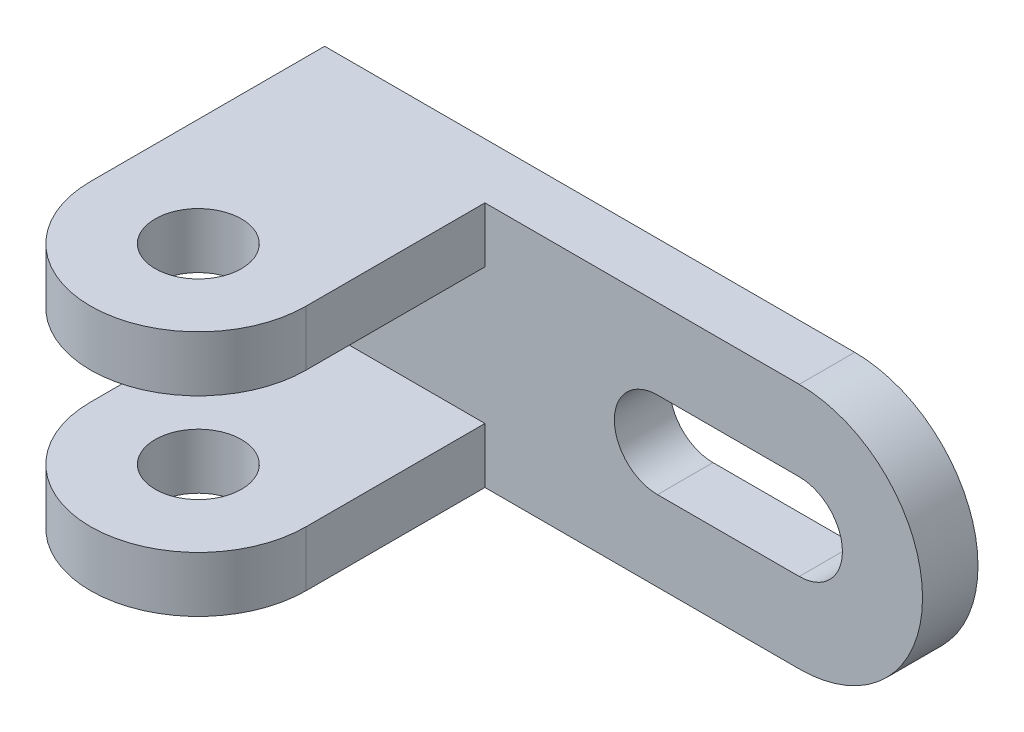
ISO-10303-21;
HEADER;
FILE_DESCRIPTION(('STEP AP214'),'2;1');
FILE_NAME('part.step','',(''),(''),'','','');
FILE_SCHEMA(('AUTOMOTIVE_DESIGN { 1 0 10303 214 1 1 1 1 }'));
ENDSEC;
DATA;
#1=APPLICATION_CONTEXT('core data for automotive mechanical design processes');
#2=APPLICATION_PROTOCOL_DEFINITION('international standard','automotive_design',2000,#1);
#3=PRODUCT_CONTEXT('',#1,'mechanical');
#4=PRODUCT('Part','Part','',(#3));
#5=PRODUCT_RELATED_PRODUCT_CATEGORY('part','',(#4));
#6=PRODUCT_DEFINITION_FORMATION('','',#4);
#7=PRODUCT_DEFINITION_CONTEXT('part definition',#1,'design');
#8=PRODUCT_DEFINITION('design','',#6,#7);
#9=PRODUCT_DEFINITION_SHAPE('','',#8);
#10=(LENGTH_UNIT() NAMED_UNIT(*) SI_UNIT(.MILLI.,.METRE.));
#11=(NAMED_UNIT(*) PLANE_ANGLE_UNIT() SI_UNIT($,.RADIAN.));
#12=(NAMED_UNIT(*) SI_UNIT($,.STERADIAN.) SOLID_ANGLE_UNIT());
#13=UNCERTAINTY_MEASURE_WITH_UNIT(LENGTH_MEASURE(1.E-05),#10,'distance_accuracy_value','');
#14=(GEOMETRIC_REPRESENTATION_CONTEXT(3) GLOBAL_UNCERTAINTY_ASSIGNED_CONTEXT((#13)) GLOBAL_UNIT_ASSIGNED_CONTEXT((#10,
#11,#12)) REPRESENTATION_CONTEXT('',''));
#15=CARTESIAN_POINT('',(0.,0.,0.));
#16=DIRECTION('',(0.,0.,1.));
#17=DIRECTION('',(1.,0.,0.));
#18=AXIS2_PLACEMENT_3D('',#15,#16,#17);
#19=CARTESIAN_POINT('',(86.,0.,9.));
#20=DIRECTION('',(0.,0.,1.));
#21=DIRECTION('',(1.,0.,0.));
#22=AXIS2_PLACEMENT_3D('',#19,#20,#21);
#23=PLANE('',#22);
#24=DIRECTION('',(1.,0.,0.));
#25=VECTOR('',#24,1.);
#26=CARTESIAN_POINT('',(63.,-7.,9.));
#27=LINE('',#26,#25);
#28=CARTESIAN_POINT('',(63.,-7.,9.));
#29=VERTEX_POINT('',#28);
#30=CARTESIAN_POINT('',(86.,-7.,9.));
#31=VERTEX_POINT('',#30);
#32=EDGE_CURVE('E229',#29,#31,#27,.T.);
#33=ORIENTED_EDGE('',*,*,#32,.F.);
#34=CARTESIAN_POINT('',(63.,0.,9.));
#35=DIRECTION('',(0.,0.,1.));
#36=DIRECTION('',(1.,0.,0.));
#37=AXIS2_PLACEMENT_3D('',#34,#35,#36);
#38=CIRCLE('',#37,7.);
#39=CARTESIAN_POINT('',(63.,7.,9.));
#40=VERTEX_POINT('',#39);
#41=EDGE_CURVE('E226',#40,#29,#38,.T.);
#42=ORIENTED_EDGE('',*,*,#41,.F.);
#43=DIRECTION('',(-1.,0.,0.));
#44=VECTOR('',#43,1.);
#45=CARTESIAN_POINT('',(63.,7.,9.));
#46=LINE('',#45,#44);
#47=CARTESIAN_POINT('',(86.,7.,9.));
#48=VERTEX_POINT('',#47);
#49=EDGE_CURVE('E237',#48,#40,#46,.T.);
#50=ORIENTED_EDGE('',*,*,#49,.F.);
#51=CARTESIAN_POINT('',(86.,0.,9.));
#52=DIRECTION('',(0.,0.,1.));
#53=DIRECTION('',(1.,0.,0.));
#54=AXIS2_PLACEMENT_3D('',#51,#52,#53);
#55=CIRCLE('',#54,7.);
#56=EDGE_CURVE('E233',#31,#48,#55,.T.);
#57=ORIENTED_EDGE('',*,*,#56,.F.);
#58=EDGE_LOOP('',(#33,#42,#50,#57));
#59=FACE_BOUND('',#58,.T.);
#60=DIRECTION('',(-1.,0.,0.));
#61=VECTOR('',#60,1.);
#62=CARTESIAN_POINT('',(0.,20.,9.));
#63=LINE('',#62,#61);
#64=CARTESIAN_POINT('',(86.,20.,9.));
#65=VERTEX_POINT('',#64);
#66=CARTESIAN_POINT('',(35.,20.,9.));
#67=VERTEX_POINT('',#66);
#68=EDGE_CURVE('E278',#65,#67,#63,.T.);
#69=ORIENTED_EDGE('',*,*,#68,.T.);
#70=DIRECTION('',(0.,-1.,0.));
#71=VECTOR('',#70,1.);
#72=CARTESIAN_POINT('',(35.,0.,9.));
#73=LINE('',#72,#71);
#74=CARTESIAN_POINT('',(35.,11.,9.));
#75=VERTEX_POINT('',#74);
#76=EDGE_CURVE('E61',#67,#75,#73,.T.);
#77=ORIENTED_EDGE('',*,*,#76,.T.);
#78=DIRECTION('',(-1.,0.,0.));
#79=VECTOR('',#78,1.);
#80=CARTESIAN_POINT('',(86.,11.,9.));
#81=LINE('',#80,#79);
#82=CARTESIAN_POINT('',(0.,11.,9.));
#83=VERTEX_POINT('',#82);
#84=EDGE_CURVE('E65',#75,#83,#81,.T.);
#85=ORIENTED_EDGE('',*,*,#84,.T.);
#86=DIRECTION('',(0.,-1.,0.));
#87=VECTOR('',#86,1.);
#88=CARTESIAN_POINT('',(0.,-20.,9.));
#89=LINE('',#88,#87);
#90=CARTESIAN_POINT('',(0.,-11.,9.));
#91=VERTEX_POINT('',#90);
#92=EDGE_CURVE('E152',#83,#91,#89,.T.);
#93=ORIENTED_EDGE('',*,*,#92,.T.);
#94=DIRECTION('',(1.,0.,0.));
#95=VECTOR('',#94,1.);
#96=CARTESIAN_POINT('',(86.,-11.,9.));
#97=LINE('',#96,#95);
#98=CARTESIAN_POINT('',(35.,-11.,9.));
#99=VERTEX_POINT('',#98);
#100=EDGE_CURVE('E222',#91,#99,#97,.T.);
#101=ORIENTED_EDGE('',*,*,#100,.T.);
#102=DIRECTION('',(0.,1.,0.));
#103=VECTOR('',#102,1.);
#104=CARTESIAN_POINT('',(35.,0.,9.));
#105=LINE('',#104,#103);
#106=CARTESIAN_POINT('',(35.,-20.,9.));
#107=VERTEX_POINT('',#106);
#108=EDGE_CURVE('E215',#107,#99,#105,.T.);
#109=ORIENTED_EDGE('',*,*,#108,.F.);
#110=DIRECTION('',(1.,0.,0.));
#111=VECTOR('',#110,1.);
#112=CARTESIAN_POINT('',(0.,-20.,9.));
#113=LINE('',#112,#111);
#114=CARTESIAN_POINT('',(86.,-20.,9.));
#115=VERTEX_POINT('',#114);
#116=EDGE_CURVE('E271',#107,#115,#113,.T.);
#117=ORIENTED_EDGE('',*,*,#116,.T.);
#118=CARTESIAN_POINT('',(86.,0.,9.));
#119=DIRECTION('',(0.,0.,1.));
#120=DIRECTION('',(1.,0.,0.));
#121=AXIS2_PLACEMENT_3D('',#118,#119,#120);
#122=CIRCLE('',#121,20.);
#123=EDGE_CURVE('E275',#115,#65,#122,.T.);
#124=ORIENTED_EDGE('',*,*,#123,.T.);
#125=EDGE_LOOP('',(#69,#77,#85,#93,#101,#109,#117,#124));
#126=FACE_BOUND('',#125,.T.);
#127=ADVANCED_FACE('F45',(#59,#126),#23,.T.);
#128=CARTESIAN_POINT('',(86.,0.,0.));
#129=DIRECTION('',(0.,0.,1.));
#130=DIRECTION('',(1.,0.,0.));
#131=AXIS2_PLACEMENT_3D('',#128,#129,#130);
#132=PLANE('',#131);
#133=DIRECTION('',(0.,-1.,0.));
#134=VECTOR('',#133,1.);
#135=CARTESIAN_POINT('',(0.,-20.,0.));
#136=LINE('',#135,#134);
#137=CARTESIAN_POINT('',(0.,20.,0.));
#138=VERTEX_POINT('',#137);
#139=CARTESIAN_POINT('',(0.,-20.,0.));
#140=VERTEX_POINT('',#139);
#141=EDGE_CURVE('E268',#138,#140,#136,.T.);
#142=ORIENTED_EDGE('',*,*,#141,.F.);
#143=DIRECTION('',(-1.,0.,0.));
#144=VECTOR('',#143,1.);
#145=CARTESIAN_POINT('',(0.,20.,0.));
#146=LINE('',#145,#144);
#147=CARTESIAN_POINT('',(86.,20.,0.));
#148=VERTEX_POINT('',#147);
#149=EDGE_CURVE('E272',#148,#138,#146,.T.);
#150=ORIENTED_EDGE('',*,*,#149,.F.);
#151=CARTESIAN_POINT('',(86.,0.,0.));
#152=DIRECTION('',(0.,0.,1.));
#153=DIRECTION('',(1.,0.,0.));
#154=AXIS2_PLACEMENT_3D('',#151,#152,#153);
#155=CIRCLE('',#154,20.);
#156=CARTESIAN_POINT('',(86.,-20.,0.));
#157=VERTEX_POINT('',#156);
#158=EDGE_CURVE('E287',#157,#148,#155,.T.);
#159=ORIENTED_EDGE('',*,*,#158,.F.);
#160=DIRECTION('',(1.,0.,0.));
#161=VECTOR('',#160,1.);
#162=CARTESIAN_POINT('',(0.,-20.,0.));
#163=LINE('',#162,#161);
#164=EDGE_CURVE('E284',#140,#157,#163,.T.);
#165=ORIENTED_EDGE('',*,*,#164,.F.);
#166=EDGE_LOOP('',(#142,#150,#159,#165));
#167=FACE_BOUND('',#166,.T.);
#168=CARTESIAN_POINT('',(63.,0.,0.));
#169=DIRECTION('',(0.,0.,1.));
#170=DIRECTION('',(1.,0.,0.));
#171=AXIS2_PLACEMENT_3D('',#168,#169,#170);
#172=CIRCLE('',#171,7.);
#173=CARTESIAN_POINT('',(63.,7.,0.));
#174=VERTEX_POINT('',#173);
#175=CARTESIAN_POINT('',(63.,-7.,0.));
#176=VERTEX_POINT('',#175);
#177=EDGE_CURVE('E225',#174,#176,#172,.T.);
#178=ORIENTED_EDGE('',*,*,#177,.T.);
#179=DIRECTION('',(1.,0.,0.));
#180=VECTOR('',#179,1.);
#181=CARTESIAN_POINT('',(63.,-7.,0.));
#182=LINE('',#181,#180);
#183=CARTESIAN_POINT('',(86.,-7.,0.));
#184=VERTEX_POINT('',#183);
#185=EDGE_CURVE('E244',#176,#184,#182,.T.);
#186=ORIENTED_EDGE('',*,*,#185,.T.);
#187=CARTESIAN_POINT('',(86.,0.,0.));
#188=DIRECTION('',(0.,0.,1.));
#189=DIRECTION('',(1.,0.,0.));
#190=AXIS2_PLACEMENT_3D('',#187,#188,#189);
#191=CIRCLE('',#190,7.);
#192=CARTESIAN_POINT('',(86.,7.,0.));
#193=VERTEX_POINT('',#192);
#194=EDGE_CURVE('E248',#184,#193,#191,.T.);
#195=ORIENTED_EDGE('',*,*,#194,.T.);
#196=DIRECTION('',(-1.,0.,0.));
#197=VECTOR('',#196,1.);
#198=CARTESIAN_POINT('',(63.,7.,0.));
#199=LINE('',#198,#197);
#200=EDGE_CURVE('E230',#193,#174,#199,.T.);
#201=ORIENTED_EDGE('',*,*,#200,.T.);
#202=EDGE_LOOP('',(#178,#186,#195,#201));
#203=FACE_BOUND('',#202,.T.);
#204=ADVANCED_FACE('F310',(#167,#203),#132,.F.);
#205=CARTESIAN_POINT('',(0.,-20.,9.));
#206=DIRECTION('',(1.,0.,0.));
#207=DIRECTION('',(0.,0.,-1.));
#208=AXIS2_PLACEMENT_3D('',#205,#206,#207);
#209=PLANE('',#208);
#210=ORIENTED_EDGE('',*,*,#141,.T.);
#211=DIRECTION('',(0.,0.,-1.));
#212=VECTOR('',#211,1.);
#213=CARTESIAN_POINT('',(0.,-20.,9.));
#214=LINE('',#213,#212);
#215=CARTESIAN_POINT('',(0.,-20.,38.));
#216=VERTEX_POINT('',#215);
#217=EDGE_CURVE('E11',#216,#140,#214,.T.);
#218=ORIENTED_EDGE('',*,*,#217,.F.);
#219=DIRECTION('',(0.,-1.,0.));
#220=VECTOR('',#219,1.);
#221=CARTESIAN_POINT('',(0.,-11.,38.));
#222=LINE('',#221,#220);
#223=CARTESIAN_POINT('',(0.,-11.,38.));
#224=VERTEX_POINT('',#223);
#225=EDGE_CURVE('E211',#224,#216,#222,.T.);
#226=ORIENTED_EDGE('',*,*,#225,.F.);
#227=DIRECTION('',(0.,0.,1.));
#228=VECTOR('',#227,1.);
#229=CARTESIAN_POINT('',(0.,-11.,0.));
#230=LINE('',#229,#228);
#231=EDGE_CURVE('E194',#91,#224,#230,.T.);
#232=ORIENTED_EDGE('',*,*,#231,.F.);
#233=ORIENTED_EDGE('',*,*,#92,.F.);
#234=DIRECTION('',(0.,0.,1.));
#235=VECTOR('',#234,1.);
#236=CARTESIAN_POINT('',(0.,11.,0.));
#237=LINE('',#236,#235);
#238=CARTESIAN_POINT('',(0.,11.,38.));
#239=VERTEX_POINT('',#238);
#240=EDGE_CURVE('E145',#83,#239,#237,.T.);
#241=ORIENTED_EDGE('',*,*,#240,.T.);
#242=DIRECTION('',(0.,1.,0.));
#243=VECTOR('',#242,1.);
#244=CARTESIAN_POINT('',(0.,11.,38.));
#245=LINE('',#244,#243);
#246=CARTESIAN_POINT('',(0.,20.,38.));
#247=VERTEX_POINT('',#246);
#248=EDGE_CURVE('E149',#239,#247,#245,.T.);
#249=ORIENTED_EDGE('',*,*,#248,.T.);
#250=DIRECTION('',(0.,0.,-1.));
#251=VECTOR('',#250,1.);
#252=CARTESIAN_POINT('',(0.,20.,9.));
#253=LINE('',#252,#251);
#254=EDGE_CURVE('E281',#247,#138,#253,.T.);
#255=ORIENTED_EDGE('',*,*,#254,.T.);
#256=EDGE_LOOP('',(#210,#218,#226,#232,#233,#241,#249,#255));
#257=FACE_BOUND('',#256,.T.);
#258=ADVANCED_FACE('F47',(#257),#209,.F.);
#259=CARTESIAN_POINT('',(0.,-20.,9.));
#260=DIRECTION('',(0.,1.,0.));
#261=DIRECTION('',(-1.,0.,0.));
#262=AXIS2_PLACEMENT_3D('',#259,#260,#261);
#263=PLANE('',#262);
#264=ORIENTED_EDGE('',*,*,#116,.F.);
#265=DIRECTION('',(0.,0.,1.));
#266=VECTOR('',#265,1.);
#267=CARTESIAN_POINT('',(35.,-20.,0.));
#268=LINE('',#267,#266);
#269=CARTESIAN_POINT('',(35.,-20.,38.));
#270=VERTEX_POINT('',#269);
#271=EDGE_CURVE('E185',#107,#270,#268,.T.);
#272=ORIENTED_EDGE('',*,*,#271,.T.);
#273=CARTESIAN_POINT('',(17.5,-20.,38.));
#274=DIRECTION('',(0.,-1.,0.));
#275=DIRECTION('',(1.,0.,0.));
#276=AXIS2_PLACEMENT_3D('',#273,#274,#275);
#277=CIRCLE('',#276,17.5);
#278=EDGE_CURVE('E204',#270,#216,#277,.T.);
#279=ORIENTED_EDGE('',*,*,#278,.T.);
#280=ORIENTED_EDGE('',*,*,#217,.T.);
#281=ORIENTED_EDGE('',*,*,#164,.T.);
#282=DIRECTION('',(0.,0.,-1.));
#283=VECTOR('',#282,1.);
#284=CARTESIAN_POINT('',(86.,-20.,9.));
#285=LINE('',#284,#283);
#286=EDGE_CURVE('E54',#115,#157,#285,.T.);
#287=ORIENTED_EDGE('',*,*,#286,.F.);
#288=EDGE_LOOP('',(#264,#272,#279,#280,#281,#287));
#289=FACE_BOUND('',#288,.T.);
#290=CARTESIAN_POINT('',(17.5,-20.,38.));
#291=DIRECTION('',(0.,-1.,0.));
#292=DIRECTION('',(1.,0.,0.));
#293=AXIS2_PLACEMENT_3D('',#290,#291,#292);
#294=CIRCLE('',#293,7.);
#295=CARTESIAN_POINT('',(24.5,-20.,38.));
#296=VERTEX_POINT('',#295);
#297=EDGE_CURVE('E190',#296,#296,#294,.T.);
#298=ORIENTED_EDGE('',*,*,#297,.F.);
#299=EDGE_LOOP('',(#298));
#300=FACE_BOUND('',#299,.T.);
#301=ADVANCED_FACE('F322',(#289,#300),#263,.F.);
#302=CARTESIAN_POINT('',(86.,0.,9.));
#303=DIRECTION('',(0.,0.,-1.));
#304=DIRECTION('',(-1.,0.,0.));
#305=AXIS2_PLACEMENT_3D('',#302,#303,#304);
#306=CYLINDRICAL_SURFACE('',#305,20.);
#307=ORIENTED_EDGE('',*,*,#158,.T.);
#308=DIRECTION('',(0.,0.,-1.));
#309=VECTOR('',#308,1.);
#310=CARTESIAN_POINT('',(86.,20.,9.));
#311=LINE('',#310,#309);
#312=EDGE_CURVE('E294',#65,#148,#311,.T.);
#313=ORIENTED_EDGE('',*,*,#312,.F.);
#314=ORIENTED_EDGE('',*,*,#123,.F.);
#315=ORIENTED_EDGE('',*,*,#286,.T.);
#316=EDGE_LOOP('',(#307,#313,#314,#315));
#317=FACE_BOUND('',#316,.T.);
#318=ADVANCED_FACE('F303',(#317),#306,.T.);
#319=CARTESIAN_POINT('',(0.,20.,9.));
#320=DIRECTION('',(0.,-1.,0.));
#321=DIRECTION('',(1.,0.,0.));
#322=AXIS2_PLACEMENT_3D('',#319,#320,#321);
#323=PLANE('',#322);
#324=ORIENTED_EDGE('',*,*,#254,.F.);
#325=CARTESIAN_POINT('',(17.5,20.,38.));
#326=DIRECTION('',(0.,-1.,0.));
#327=DIRECTION('',(1.,0.,0.));
#328=AXIS2_PLACEMENT_3D('',#325,#326,#327);
#329=CIRCLE('',#328,17.5);
#330=CARTESIAN_POINT('',(35.,20.,38.));
#331=VERTEX_POINT('',#330);
#332=EDGE_CURVE('E170',#331,#247,#329,.T.);
#333=ORIENTED_EDGE('',*,*,#332,.F.);
#334=DIRECTION('',(0.,0.,1.));
#335=VECTOR('',#334,1.);
#336=CARTESIAN_POINT('',(35.,20.,0.));
#337=LINE('',#336,#335);
#338=EDGE_CURVE('E334',#67,#331,#337,.T.);
#339=ORIENTED_EDGE('',*,*,#338,.F.);
#340=ORIENTED_EDGE('',*,*,#68,.F.);
#341=ORIENTED_EDGE('',*,*,#312,.T.);
#342=ORIENTED_EDGE('',*,*,#149,.T.);
#343=EDGE_LOOP('',(#324,#333,#339,#340,#341,#342));
#344=FACE_BOUND('',#343,.T.);
#345=CARTESIAN_POINT('',(17.5,20.,38.));
#346=DIRECTION('',(0.,-1.,0.));
#347=DIRECTION('',(1.,0.,0.));
#348=AXIS2_PLACEMENT_3D('',#345,#346,#347);
#349=CIRCLE('',#348,7.);
#350=CARTESIAN_POINT('',(24.5,20.,38.));
#351=VERTEX_POINT('',#350);
#352=EDGE_CURVE('E339',#351,#351,#349,.T.);
#353=ORIENTED_EDGE('',*,*,#352,.T.);
#354=EDGE_LOOP('',(#353));
#355=FACE_BOUND('',#354,.T.);
#356=ADVANCED_FACE('F313',(#344,#355),#323,.F.);
#357=CARTESIAN_POINT('',(63.,0.,9.));
#358=DIRECTION('',(0.,0.,-1.));
#359=DIRECTION('',(-1.,0.,0.));
#360=AXIS2_PLACEMENT_3D('',#357,#358,#359);
#361=CYLINDRICAL_SURFACE('',#360,7.);
#362=ORIENTED_EDGE('',*,*,#177,.F.);
#363=DIRECTION('',(0.,0.,-1.));
#364=VECTOR('',#363,1.);
#365=CARTESIAN_POINT('',(63.,7.,9.));
#366=LINE('',#365,#364);
#367=EDGE_CURVE('E240',#40,#174,#366,.T.);
#368=ORIENTED_EDGE('',*,*,#367,.F.);
#369=ORIENTED_EDGE('',*,*,#41,.T.);
#370=DIRECTION('',(0.,0.,-1.));
#371=VECTOR('',#370,1.);
#372=CARTESIAN_POINT('',(63.,-7.,9.));
#373=LINE('',#372,#371);
#374=EDGE_CURVE('E264',#29,#176,#373,.T.);
#375=ORIENTED_EDGE('',*,*,#374,.T.);
#376=EDGE_LOOP('',(#362,#368,#369,#375));
#377=FACE_BOUND('',#376,.T.);
#378=ADVANCED_FACE('F367',(#377),#361,.F.);
#379=CARTESIAN_POINT('',(63.,-7.,9.));
#380=DIRECTION('',(0.,1.,0.));
#381=DIRECTION('',(0.,0.,1.));
#382=AXIS2_PLACEMENT_3D('',#379,#380,#381);
#383=PLANE('',#382);
#384=ORIENTED_EDGE('',*,*,#185,.F.);
#385=ORIENTED_EDGE('',*,*,#374,.F.);
#386=ORIENTED_EDGE('',*,*,#32,.T.);
#387=DIRECTION('',(0.,0.,-1.));
#388=VECTOR('',#387,1.);
#389=CARTESIAN_POINT('',(86.,-7.,9.));
#390=LINE('',#389,#388);
#391=EDGE_CURVE('E261',#31,#184,#390,.T.);
#392=ORIENTED_EDGE('',*,*,#391,.T.);
#393=EDGE_LOOP('',(#384,#385,#386,#392));
#394=FACE_BOUND('',#393,.T.);
#395=ADVANCED_FACE('F459',(#394),#383,.T.);
#396=CARTESIAN_POINT('',(86.,0.,9.));
#397=DIRECTION('',(0.,0.,-1.));
#398=DIRECTION('',(-1.,0.,0.));
#399=AXIS2_PLACEMENT_3D('',#396,#397,#398);
#400=CYLINDRICAL_SURFACE('',#399,7.);
#401=ORIENTED_EDGE('',*,*,#194,.F.);
#402=ORIENTED_EDGE('',*,*,#391,.F.);
#403=ORIENTED_EDGE('',*,*,#56,.T.);
#404=DIRECTION('',(0.,0.,-1.));
#405=VECTOR('',#404,1.);
#406=CARTESIAN_POINT('',(86.,7.,9.));
#407=LINE('',#406,#405);
#408=EDGE_CURVE('E258',#48,#193,#407,.T.);
#409=ORIENTED_EDGE('',*,*,#408,.T.);
#410=EDGE_LOOP('',(#401,#402,#403,#409));
#411=FACE_BOUND('',#410,.T.);
#412=ADVANCED_FACE('F447',(#411),#400,.F.);
#413=CARTESIAN_POINT('',(63.,7.,9.));
#414=DIRECTION('',(0.,-1.,0.));
#415=DIRECTION('',(0.,0.,-1.));
#416=AXIS2_PLACEMENT_3D('',#413,#414,#415);
#417=PLANE('',#416);
#418=ORIENTED_EDGE('',*,*,#200,.F.);
#419=ORIENTED_EDGE('',*,*,#408,.F.);
#420=ORIENTED_EDGE('',*,*,#49,.T.);
#421=ORIENTED_EDGE('',*,*,#367,.T.);
#422=EDGE_LOOP('',(#418,#419,#420,#421));
#423=FACE_BOUND('',#422,.T.);
#424=ADVANCED_FACE('F431',(#423),#417,.T.);
#425=CARTESIAN_POINT('',(35.,-11.,0.));
#426=DIRECTION('',(1.,0.,0.));
#427=DIRECTION('',(0.,1.,0.));
#428=AXIS2_PLACEMENT_3D('',#425,#426,#427);
#429=PLANE('',#428);
#430=ORIENTED_EDGE('',*,*,#271,.F.);
#431=ORIENTED_EDGE('',*,*,#108,.T.);
#432=DIRECTION('',(0.,0.,1.));
#433=VECTOR('',#432,1.);
#434=CARTESIAN_POINT('',(35.,-11.,0.));
#435=LINE('',#434,#433);
#436=CARTESIAN_POINT('',(35.,-11.,38.));
#437=VERTEX_POINT('',#436);
#438=EDGE_CURVE('E186',#99,#437,#435,.T.);
#439=ORIENTED_EDGE('',*,*,#438,.T.);
#440=DIRECTION('',(0.,-1.,0.));
#441=VECTOR('',#440,1.);
#442=CARTESIAN_POINT('',(35.,-11.,38.));
#443=LINE('',#442,#441);
#444=EDGE_CURVE('E201',#437,#270,#443,.T.);
#445=ORIENTED_EDGE('',*,*,#444,.T.);
#446=EDGE_LOOP('',(#430,#431,#439,#445));
#447=FACE_BOUND('',#446,.T.);
#448=ADVANCED_FACE('F327',(#447),#429,.T.);
#449=CARTESIAN_POINT('',(17.5,-11.,38.));
#450=DIRECTION('',(0.,-1.,0.));
#451=DIRECTION('',(1.,0.,0.));
#452=AXIS2_PLACEMENT_3D('',#449,#450,#451);
#453=CYLINDRICAL_SURFACE('',#452,17.5);
#454=ORIENTED_EDGE('',*,*,#278,.F.);
#455=ORIENTED_EDGE('',*,*,#444,.F.);
#456=CARTESIAN_POINT('',(17.5,-11.,38.));
#457=DIRECTION('',(0.,-1.,0.));
#458=DIRECTION('',(1.,0.,0.));
#459=AXIS2_PLACEMENT_3D('',#456,#457,#458);
#460=CIRCLE('',#459,17.5);
#461=EDGE_CURVE('E189',#437,#224,#460,.T.);
#462=ORIENTED_EDGE('',*,*,#461,.T.);
#463=ORIENTED_EDGE('',*,*,#225,.T.);
#464=EDGE_LOOP('',(#454,#455,#462,#463));
#465=FACE_BOUND('',#464,.T.);
#466=ADVANCED_FACE('F319',(#465),#453,.T.);
#467=CARTESIAN_POINT('',(17.5,-11.,38.));
#468=DIRECTION('',(0.,-1.,0.));
#469=DIRECTION('',(1.,0.,0.));
#470=AXIS2_PLACEMENT_3D('',#467,#468,#469);
#471=CYLINDRICAL_SURFACE('',#470,7.);
#472=CARTESIAN_POINT('',(17.5,-11.,38.));
#473=DIRECTION('',(0.,-1.,0.));
#474=DIRECTION('',(1.,0.,0.));
#475=AXIS2_PLACEMENT_3D('',#472,#473,#474);
#476=CIRCLE('',#475,7.);
#477=CARTESIAN_POINT('',(24.5,-11.,38.));
#478=VERTEX_POINT('',#477);
#479=EDGE_CURVE('E197',#478,#478,#476,.T.);
#480=ORIENTED_EDGE('',*,*,#479,.F.);
#481=EDGE_LOOP('',(#480));
#482=FACE_BOUND('',#481,.T.);
#483=ORIENTED_EDGE('',*,*,#297,.T.);
#484=EDGE_LOOP('',(#483));
#485=FACE_BOUND('',#484,.T.);
#486=ADVANCED_FACE('F401',(#482,#485),#471,.F.);
#487=CARTESIAN_POINT('',(0.,-11.,0.));
#488=DIRECTION('',(0.,-1.,0.));
#489=DIRECTION('',(1.,0.,0.));
#490=AXIS2_PLACEMENT_3D('',#487,#488,#489);
#491=PLANE('',#490);
#492=ORIENTED_EDGE('',*,*,#100,.F.);
#493=ORIENTED_EDGE('',*,*,#231,.T.);
#494=ORIENTED_EDGE('',*,*,#461,.F.);
#495=ORIENTED_EDGE('',*,*,#438,.F.);
#496=EDGE_LOOP('',(#492,#493,#494,#495));
#497=FACE_BOUND('',#496,.T.);
#498=ORIENTED_EDGE('',*,*,#479,.T.);
#499=EDGE_LOOP('',(#498));
#500=FACE_BOUND('',#499,.T.);
#501=ADVANCED_FACE('F331',(#497,#500),#491,.F.);
#502=CARTESIAN_POINT('',(35.,11.,0.));
#503=DIRECTION('',(-1.,0.,0.));
#504=DIRECTION('',(0.,-1.,0.));
#505=AXIS2_PLACEMENT_3D('',#502,#503,#504);
#506=PLANE('',#505);
#507=ORIENTED_EDGE('',*,*,#76,.F.);
#508=ORIENTED_EDGE('',*,*,#338,.T.);
#509=DIRECTION('',(0.,1.,0.));
#510=VECTOR('',#509,1.);
#511=CARTESIAN_POINT('',(35.,11.,38.));
#512=LINE('',#511,#510);
#513=CARTESIAN_POINT('',(35.,11.,38.));
#514=VERTEX_POINT('',#513);
#515=EDGE_CURVE('E172',#514,#331,#512,.T.);
#516=ORIENTED_EDGE('',*,*,#515,.F.);
#517=DIRECTION('',(0.,0.,1.));
#518=VECTOR('',#517,1.);
#519=CARTESIAN_POINT('',(35.,11.,0.));
#520=LINE('',#519,#518);
#521=EDGE_CURVE('E156',#75,#514,#520,.T.);
#522=ORIENTED_EDGE('',*,*,#521,.F.);
#523=EDGE_LOOP('',(#507,#508,#516,#522));
#524=FACE_BOUND('',#523,.T.);
#525=ADVANCED_FACE('F356',(#524),#506,.F.);
#526=CARTESIAN_POINT('',(17.5,11.,38.));
#527=DIRECTION('',(0.,1.,0.));
#528=DIRECTION('',(-1.,0.,0.));
#529=AXIS2_PLACEMENT_3D('',#526,#527,#528);
#530=CYLINDRICAL_SURFACE('',#529,17.5);
#531=ORIENTED_EDGE('',*,*,#332,.T.);
#532=ORIENTED_EDGE('',*,*,#248,.F.);
#533=CARTESIAN_POINT('',(17.5,11.,38.));
#534=DIRECTION('',(0.,-1.,0.));
#535=DIRECTION('',(1.,0.,0.));
#536=AXIS2_PLACEMENT_3D('',#533,#534,#535);
#537=CIRCLE('',#536,17.5);
#538=EDGE_CURVE('E155',#514,#239,#537,.T.);
#539=ORIENTED_EDGE('',*,*,#538,.F.);
#540=ORIENTED_EDGE('',*,*,#515,.T.);
#541=EDGE_LOOP('',(#531,#532,#539,#540));
#542=FACE_BOUND('',#541,.T.);
#543=ADVANCED_FACE('F168',(#542),#530,.T.);
#544=CARTESIAN_POINT('',(17.5,11.,38.));
#545=DIRECTION('',(0.,1.,0.));
#546=DIRECTION('',(-1.,0.,0.));
#547=AXIS2_PLACEMENT_3D('',#544,#545,#546);
#548=CYLINDRICAL_SURFACE('',#547,7.);
#549=CARTESIAN_POINT('',(17.5,11.,38.));
#550=DIRECTION('',(0.,-1.,0.));
#551=DIRECTION('',(1.,0.,0.));
#552=AXIS2_PLACEMENT_3D('',#549,#550,#551);
#553=CIRCLE('',#552,7.);
#554=CARTESIAN_POINT('',(24.5,11.,38.));
#555=VERTEX_POINT('',#554);
#556=EDGE_CURVE('E166',#555,#555,#553,.T.);
#557=ORIENTED_EDGE('',*,*,#556,.T.);
#558=EDGE_LOOP('',(#557));
#559=FACE_BOUND('',#558,.T.);
#560=ORIENTED_EDGE('',*,*,#352,.F.);
#561=EDGE_LOOP('',(#560));
#562=FACE_BOUND('',#561,.T.);
#563=ADVANCED_FACE('F347',(#559,#562),#548,.F.);
#564=CARTESIAN_POINT('',(0.,11.,0.));
#565=DIRECTION('',(0.,1.,0.));
#566=DIRECTION('',(1.,0.,0.));
#567=AXIS2_PLACEMENT_3D('',#564,#565,#566);
#568=PLANE('',#567);
#569=ORIENTED_EDGE('',*,*,#84,.F.);
#570=ORIENTED_EDGE('',*,*,#521,.T.);
#571=ORIENTED_EDGE('',*,*,#538,.T.);
#572=ORIENTED_EDGE('',*,*,#240,.F.);
#573=EDGE_LOOP('',(#569,#570,#571,#572));
#574=FACE_BOUND('',#573,.T.);
#575=ORIENTED_EDGE('',*,*,#556,.F.);
#576=EDGE_LOOP('',(#575));
#577=FACE_BOUND('',#576,.T.);
#578=ADVANCED_FACE('F159',(#574,#577),#568,.F.);
#579=CLOSED_SHELL('',(#127,#204,#258,#301,#318,#356,#378,#395,#412,#424,#448,#466,#486,#501,
#525,#543,#563,#578));
#580=MANIFOLD_SOLID_BREP('B2',#579);
#581=ADVANCED_BREP_SHAPE_REPRESENTATION('',(#18,#580),#14);
#582=SHAPE_DEFINITION_REPRESENTATION(#9,#581);
ENDSEC;
END-ISO-10303-21;
